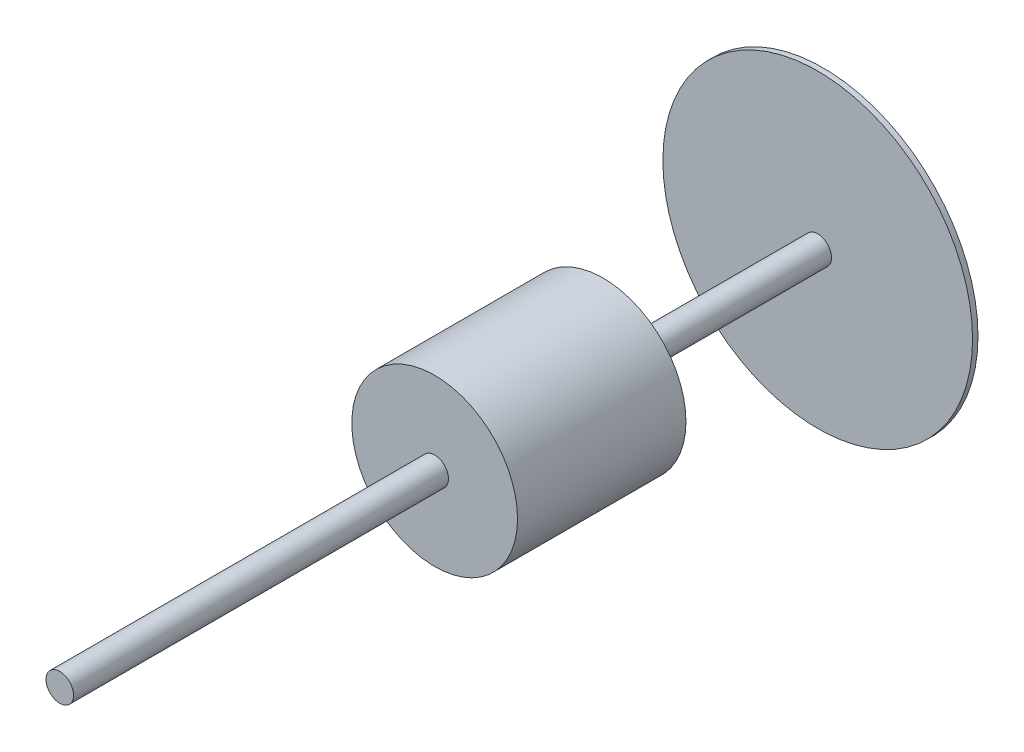
ISO-10303-21;
HEADER;
FILE_DESCRIPTION(('STEP AP214'),'2;1');
FILE_NAME('part.step','',(''),(''),'','','');
FILE_SCHEMA(('AUTOMOTIVE_DESIGN { 1 0 10303 214 1 1 1 1 }'));
ENDSEC;
DATA;
#1=APPLICATION_CONTEXT('core data for automotive mechanical design processes');
#2=APPLICATION_PROTOCOL_DEFINITION('international standard','automotive_design',2000,#1);
#3=PRODUCT_CONTEXT('',#1,'mechanical');
#4=PRODUCT('Part','Part','',(#3));
#5=PRODUCT_RELATED_PRODUCT_CATEGORY('part','',(#4));
#6=PRODUCT_DEFINITION_FORMATION('','',#4);
#7=PRODUCT_DEFINITION_CONTEXT('part definition',#1,'design');
#8=PRODUCT_DEFINITION('design','',#6,#7);
#9=PRODUCT_DEFINITION_SHAPE('','',#8);
#10=(LENGTH_UNIT() NAMED_UNIT(*) SI_UNIT(.MILLI.,.METRE.));
#11=(NAMED_UNIT(*) PLANE_ANGLE_UNIT() SI_UNIT($,.RADIAN.));
#12=(NAMED_UNIT(*) SI_UNIT($,.STERADIAN.) SOLID_ANGLE_UNIT());
#13=UNCERTAINTY_MEASURE_WITH_UNIT(LENGTH_MEASURE(1.E-05),#10,'distance_accuracy_value','');
#14=(GEOMETRIC_REPRESENTATION_CONTEXT(3) GLOBAL_UNCERTAINTY_ASSIGNED_CONTEXT((#13)) GLOBAL_UNIT_ASSIGNED_CONTEXT((#10,
#11,#12)) REPRESENTATION_CONTEXT('',''));
#15=CARTESIAN_POINT('',(0.,0.,0.));
#16=DIRECTION('',(0.,0.,1.));
#17=DIRECTION('',(1.,0.,0.));
#18=AXIS2_PLACEMENT_3D('',#15,#16,#17);
#19=CARTESIAN_POINT('',(0.,0.,130.));
#20=DIRECTION('',(0.,0.,1.));
#21=DIRECTION('',(1.,0.,0.));
#22=AXIS2_PLACEMENT_3D('',#19,#20,#21);
#23=CYLINDRICAL_SURFACE('',#22,305.);
#24=CARTESIAN_POINT('',(0.,0.,130.));
#25=DIRECTION('',(0.,0.,1.));
#26=DIRECTION('',(1.,0.,0.));
#27=AXIS2_PLACEMENT_3D('',#24,#25,#26);
#28=CIRCLE('',#27,305.);
#29=CARTESIAN_POINT('',(305.,0.,130.));
#30=VERTEX_POINT('',#29);
#31=EDGE_CURVE('E67',#30,#30,#28,.T.);
#32=ORIENTED_EDGE('',*,*,#31,.T.);
#33=EDGE_LOOP('',(#32));
#34=FACE_BOUND('',#33,.T.);
#35=CARTESIAN_POINT('',(0.,0.,750.));
#36=DIRECTION('',(0.,0.,1.));
#37=DIRECTION('',(1.,0.,0.));
#38=AXIS2_PLACEMENT_3D('',#35,#36,#37);
#39=CIRCLE('',#38,305.);
#40=CARTESIAN_POINT('',(305.,0.,750.));
#41=VERTEX_POINT('',#40);
#42=EDGE_CURVE('E78',#41,#41,#39,.T.);
#43=ORIENTED_EDGE('',*,*,#42,.F.);
#44=EDGE_LOOP('',(#43));
#45=FACE_BOUND('',#44,.T.);
#46=ADVANCED_FACE('F45',(#34,#45),#23,.T.);
#47=CARTESIAN_POINT('',(0.,0.,130.));
#48=DIRECTION('',(0.,0.,1.));
#49=DIRECTION('',(1.,0.,0.));
#50=AXIS2_PLACEMENT_3D('',#47,#48,#49);
#51=PLANE('',#50);
#52=CARTESIAN_POINT('',(0.,0.,130.));
#53=DIRECTION('',(0.,0.,1.));
#54=DIRECTION('',(1.,0.,0.));
#55=AXIS2_PLACEMENT_3D('',#52,#53,#54);
#56=CIRCLE('',#55,225.);
#57=CARTESIAN_POINT('',(225.,0.,130.));
#58=VERTEX_POINT('',#57);
#59=EDGE_CURVE('E10',#58,#58,#56,.F.);
#60=ORIENTED_EDGE('',*,*,#59,.F.);
#61=EDGE_LOOP('',(#60));
#62=FACE_BOUND('',#61,.T.);
#63=ORIENTED_EDGE('',*,*,#31,.F.);
#64=EDGE_LOOP('',(#63));
#65=FACE_BOUND('',#64,.T.);
#66=ADVANCED_FACE('F113',(#62,#65),#51,.F.);
#67=CARTESIAN_POINT('',(0.,0.,750.));
#68=DIRECTION('',(0.,0.,1.));
#69=DIRECTION('',(1.,0.,0.));
#70=AXIS2_PLACEMENT_3D('',#67,#68,#69);
#71=PLANE('',#70);
#72=CARTESIAN_POINT('',(0.,0.,750.));
#73=DIRECTION('',(0.,0.,1.));
#74=DIRECTION('',(1.,0.,0.));
#75=AXIS2_PLACEMENT_3D('',#72,#73,#74);
#76=CIRCLE('',#75,50.8);
#77=CARTESIAN_POINT('',(50.8,0.,750.));
#78=VERTEX_POINT('',#77);
#79=EDGE_CURVE('E62',#78,#78,#76,.T.);
#80=ORIENTED_EDGE('',*,*,#79,.F.);
#81=EDGE_LOOP('',(#80));
#82=FACE_BOUND('',#81,.T.);
#83=ORIENTED_EDGE('',*,*,#42,.T.);
#84=EDGE_LOOP('',(#83));
#85=FACE_BOUND('',#84,.T.);
#86=ADVANCED_FACE('F120',(#82,#85),#71,.T.);
#87=CARTESIAN_POINT('',(0.,0.,2130.));
#88=DIRECTION('',(0.,0.,1.));
#89=DIRECTION('',(1.,0.,0.));
#90=AXIS2_PLACEMENT_3D('',#87,#88,#89);
#91=PLANE('',#90);
#92=CARTESIAN_POINT('',(0.,0.,2130.));
#93=DIRECTION('',(0.,0.,1.));
#94=DIRECTION('',(1.,0.,0.));
#95=AXIS2_PLACEMENT_3D('',#92,#93,#94);
#96=CIRCLE('',#95,50.8);
#97=CARTESIAN_POINT('',(50.8,0.,2130.));
#98=VERTEX_POINT('',#97);
#99=EDGE_CURVE('E54',#98,#98,#96,.T.);
#100=ORIENTED_EDGE('',*,*,#99,.T.);
#101=EDGE_LOOP('',(#100));
#102=FACE_BOUND('',#101,.T.);
#103=ADVANCED_FACE('F132',(#102),#91,.T.);
#104=CARTESIAN_POINT('',(0.,0.,2130.));
#105=DIRECTION('',(0.,0.,-1.));
#106=DIRECTION('',(-1.,0.,0.));
#107=AXIS2_PLACEMENT_3D('',#104,#105,#106);
#108=CYLINDRICAL_SURFACE('',#107,50.8);
#109=ORIENTED_EDGE('',*,*,#79,.T.);
#110=EDGE_LOOP('',(#109));
#111=FACE_BOUND('',#110,.T.);
#112=ORIENTED_EDGE('',*,*,#99,.F.);
#113=EDGE_LOOP('',(#112));
#114=FACE_BOUND('',#113,.T.);
#115=ADVANCED_FACE('F47',(#111,#114),#108,.T.);
#116=CARTESIAN_POINT('',(0.,0.,80.));
#117=DIRECTION('',(0.,0.,1.));
#118=DIRECTION('',(1.,0.,0.));
#119=AXIS2_PLACEMENT_3D('',#116,#117,#118);
#120=CYLINDRICAL_SURFACE('',#119,225.);
#121=CARTESIAN_POINT('',(0.,0.,80.));
#122=DIRECTION('',(0.,0.,-1.));
#123=DIRECTION('',(-1.,0.,0.));
#124=AXIS2_PLACEMENT_3D('',#121,#122,#123);
#125=CIRCLE('',#124,225.);
#126=CARTESIAN_POINT('',(-225.,0.,80.));
#127=VERTEX_POINT('',#126);
#128=EDGE_CURVE('E85',#127,#127,#125,.T.);
#129=ORIENTED_EDGE('',*,*,#128,.F.);
#130=EDGE_LOOP('',(#129));
#131=FACE_BOUND('',#130,.T.);
#132=ORIENTED_EDGE('',*,*,#59,.T.);
#133=EDGE_LOOP('',(#132));
#134=FACE_BOUND('',#133,.T.);
#135=ADVANCED_FACE('F100',(#131,#134),#120,.T.);
#136=CARTESIAN_POINT('',(0.,0.,80.));
#137=DIRECTION('',(0.,0.,-1.));
#138=DIRECTION('',(-1.,0.,0.));
#139=AXIS2_PLACEMENT_3D('',#136,#137,#138);
#140=PLANE('',#139);
#141=CARTESIAN_POINT('',(0.,0.,80.0000000000001));
#142=DIRECTION('',(0.,0.,-1.));
#143=DIRECTION('',(-1.,0.,0.));
#144=AXIS2_PLACEMENT_3D('',#141,#142,#143);
#145=CIRCLE('',#144,50.8);
#146=CARTESIAN_POINT('',(-50.8,0.,80.0000000000001));
#147=VERTEX_POINT('',#146);
#148=EDGE_CURVE('E49',#147,#147,#145,.T.);
#149=ORIENTED_EDGE('',*,*,#148,.F.);
#150=EDGE_LOOP('',(#149));
#151=FACE_BOUND('',#150,.T.);
#152=ORIENTED_EDGE('',*,*,#128,.T.);
#153=EDGE_LOOP('',(#152));
#154=FACE_BOUND('',#153,.T.);
#155=ADVANCED_FACE('F97',(#151,#154),#140,.T.);
#156=CARTESIAN_POINT('',(0.,0.,-680.));
#157=DIRECTION('',(0.,0.,1.));
#158=DIRECTION('',(1.,0.,0.));
#159=AXIS2_PLACEMENT_3D('',#156,#157,#158);
#160=PLANE('',#159);
#161=CARTESIAN_POINT('',(0.,0.,-680.));
#162=DIRECTION('',(0.,0.,1.));
#163=DIRECTION('',(1.,0.,0.));
#164=AXIS2_PLACEMENT_3D('',#161,#162,#163);
#165=CIRCLE('',#164,570.);
#166=CARTESIAN_POINT('',(570.,0.,-680.));
#167=VERTEX_POINT('',#166);
#168=EDGE_CURVE('E66',#167,#167,#165,.T.);
#169=ORIENTED_EDGE('',*,*,#168,.F.);
#170=EDGE_LOOP('',(#169));
#171=FACE_BOUND('',#170,.T.);
#172=ADVANCED_FACE('F99',(#171),#160,.F.);
#173=CARTESIAN_POINT('',(0.,0.,-660.));
#174=DIRECTION('',(0.,0.,-1.));
#175=DIRECTION('',(-1.,0.,0.));
#176=AXIS2_PLACEMENT_3D('',#173,#174,#175);
#177=CYLINDRICAL_SURFACE('',#176,570.);
#178=CARTESIAN_POINT('',(0.,0.,-660.));
#179=DIRECTION('',(0.,0.,1.));
#180=DIRECTION('',(1.,0.,0.));
#181=AXIS2_PLACEMENT_3D('',#178,#179,#180);
#182=CIRCLE('',#181,570.);
#183=CARTESIAN_POINT('',(570.,0.,-660.));
#184=VERTEX_POINT('',#183);
#185=EDGE_CURVE('E70',#184,#184,#182,.T.);
#186=ORIENTED_EDGE('',*,*,#185,.F.);
#187=EDGE_LOOP('',(#186));
#188=FACE_BOUND('',#187,.T.);
#189=ORIENTED_EDGE('',*,*,#168,.T.);
#190=EDGE_LOOP('',(#189));
#191=FACE_BOUND('',#190,.T.);
#192=ADVANCED_FACE('F107',(#188,#191),#177,.T.);
#193=CARTESIAN_POINT('',(0.,0.,-660.));
#194=DIRECTION('',(0.,0.,1.));
#195=DIRECTION('',(1.,0.,0.));
#196=AXIS2_PLACEMENT_3D('',#193,#194,#195);
#197=PLANE('',#196);
#198=CARTESIAN_POINT('',(0.,0.,-660.));
#199=DIRECTION('',(0.,0.,1.));
#200=DIRECTION('',(1.,0.,0.));
#201=AXIS2_PLACEMENT_3D('',#198,#199,#200);
#202=CIRCLE('',#201,50.8);
#203=CARTESIAN_POINT('',(50.8,0.,-660.));
#204=VERTEX_POINT('',#203);
#205=EDGE_CURVE('E59',#204,#204,#202,.T.);
#206=ORIENTED_EDGE('',*,*,#205,.F.);
#207=EDGE_LOOP('',(#206));
#208=FACE_BOUND('',#207,.T.);
#209=ORIENTED_EDGE('',*,*,#185,.T.);
#210=EDGE_LOOP('',(#209));
#211=FACE_BOUND('',#210,.T.);
#212=ADVANCED_FACE('F126',(#208,#211),#197,.T.);
#213=ORIENTED_EDGE('',*,*,#148,.T.);
#214=EDGE_LOOP('',(#213));
#215=FACE_BOUND('',#214,.T.);
#216=ORIENTED_EDGE('',*,*,#205,.T.);
#217=EDGE_LOOP('',(#216));
#218=FACE_BOUND('',#217,.T.);
#219=ADVANCED_FACE('F94',(#215,#218),#108,.T.);
#220=CLOSED_SHELL('',(#46,#66,#86,#103,#115,#135,#155,#172,#192,#212,#219));
#221=MANIFOLD_SOLID_BREP('B2',#220);
#222=ADVANCED_BREP_SHAPE_REPRESENTATION('',(#18,#221),#14);
#223=SHAPE_DEFINITION_REPRESENTATION(#9,#222);
ENDSEC;
END-ISO-10303-21;
